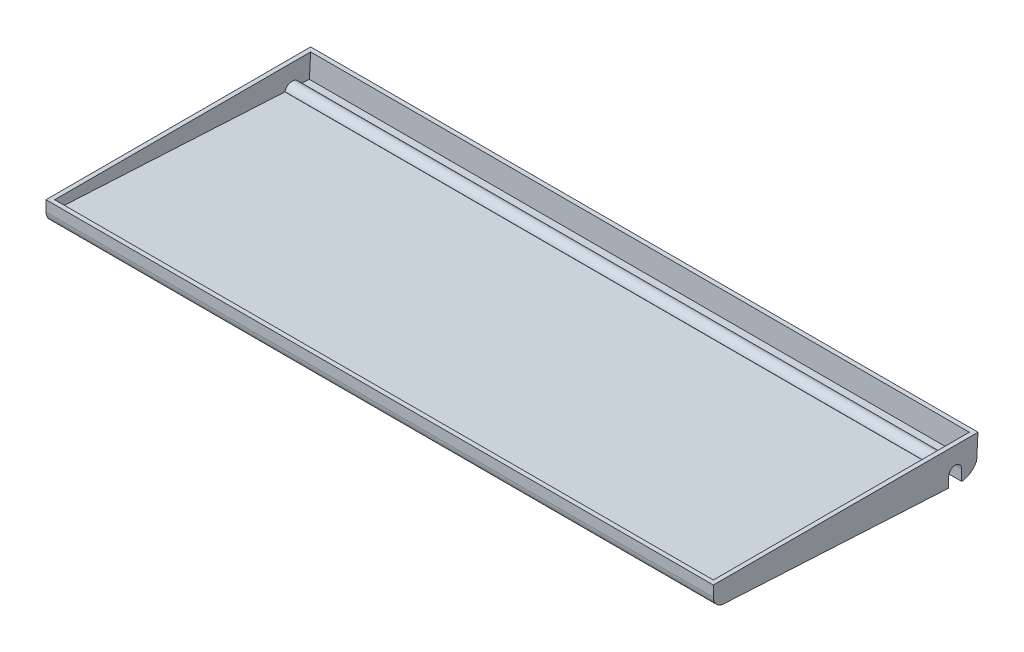
ISO-10303-21;
HEADER;
FILE_DESCRIPTION(('STEP AP214'),'2;1');
FILE_NAME('part.step','',(''),(''),'','','');
FILE_SCHEMA(('AUTOMOTIVE_DESIGN { 1 0 10303 214 1 1 1 1 }'));
ENDSEC;
DATA;
#1=APPLICATION_CONTEXT('core data for automotive mechanical design processes');
#2=APPLICATION_PROTOCOL_DEFINITION('international standard','automotive_design',2000,#1);
#3=PRODUCT_CONTEXT('',#1,'mechanical');
#4=PRODUCT('Part','Part','',(#3));
#5=PRODUCT_RELATED_PRODUCT_CATEGORY('part','',(#4));
#6=PRODUCT_DEFINITION_FORMATION('','',#4);
#7=PRODUCT_DEFINITION_CONTEXT('part definition',#1,'design');
#8=PRODUCT_DEFINITION('design','',#6,#7);
#9=PRODUCT_DEFINITION_SHAPE('','',#8);
#10=(LENGTH_UNIT() NAMED_UNIT(*) SI_UNIT(.MILLI.,.METRE.));
#11=(NAMED_UNIT(*) PLANE_ANGLE_UNIT() SI_UNIT($,.RADIAN.));
#12=(NAMED_UNIT(*) SI_UNIT($,.STERADIAN.) SOLID_ANGLE_UNIT());
#13=UNCERTAINTY_MEASURE_WITH_UNIT(LENGTH_MEASURE(1.E-05),#10,'distance_accuracy_value','');
#14=(GEOMETRIC_REPRESENTATION_CONTEXT(3) GLOBAL_UNCERTAINTY_ASSIGNED_CONTEXT((#13)) GLOBAL_UNIT_ASSIGNED_CONTEXT((#10,
#11,#12)) REPRESENTATION_CONTEXT('',''));
#15=CARTESIAN_POINT('',(0.,0.,0.));
#16=DIRECTION('',(0.,0.,1.));
#17=DIRECTION('',(1.,0.,0.));
#18=AXIS2_PLACEMENT_3D('',#15,#16,#17);
#19=CARTESIAN_POINT('',(310.007,3.55516985645839,56.4337520233221));
#20=DIRECTION('',(0.,0.998514417427364,-0.0544881472403947));
#21=DIRECTION('',(0.,0.0544881472403947,0.998514417427365));
#22=AXIS2_PLACEMENT_3D('',#19,#20,#21);
#23=PLANE('',#22);
#24=DIRECTION('',(0.,0.0544881472403947,0.998514417427365));
#25=VECTOR('',#24,1.);
#26=CARTESIAN_POINT('',(308.0004,-2.73716144424646,-58.8754269668086));
#27=LINE('',#26,#25);
#28=CARTESIAN_POINT('',(308.0004,-2.11631125757896,-47.498129447131));
#29=VERTEX_POINT('',#28);
#30=CARTESIAN_POINT('',(308.0004,3.73309519108161,59.6942962121904));
#31=VERTEX_POINT('',#30);
#32=EDGE_CURVE('E240',#29,#31,#27,.T.);
#33=ORIENTED_EDGE('',*,*,#32,.F.);
#34=DIRECTION('',(1.,0.,0.));
#35=VECTOR('',#34,1.);
#36=CARTESIAN_POINT('',(-0.002000000000002,-2.11631125757896,-47.498129447131));
#37=LINE('',#36,#35);
#38=CARTESIAN_POINT('',(2.0066,-2.11631125757896,-47.498129447131));
#39=VERTEX_POINT('',#38);
#40=EDGE_CURVE('E192',#39,#29,#37,.T.);
#41=ORIENTED_EDGE('',*,*,#40,.F.);
#42=DIRECTION('',(0.,-0.0544881472403947,-0.998514417427365));
#43=VECTOR('',#42,1.);
#44=CARTESIAN_POINT('',(2.0066,-2.73716144424646,-58.8754269668086));
#45=LINE('',#44,#43);
#46=CARTESIAN_POINT('',(2.0066,3.73309519108152,59.6942962121904));
#47=VERTEX_POINT('',#46);
#48=EDGE_CURVE('E180',#47,#39,#45,.T.);
#49=ORIENTED_EDGE('',*,*,#48,.F.);
#50=DIRECTION('',(-1.,0.,0.));
#51=VECTOR('',#50,1.);
#52=CARTESIAN_POINT('',(2.0066,3.73309519108161,59.6942962121904));
#53=LINE('',#52,#51);
#54=EDGE_CURVE('E238',#31,#47,#53,.T.);
#55=ORIENTED_EDGE('',*,*,#54,.F.);
#56=EDGE_LOOP('',(#33,#41,#49,#55));
#57=FACE_BOUND('',#56,.T.);
#58=ADVANCED_FACE('F47',(#57),#23,.T.);
#59=CARTESIAN_POINT('',(308.0004,-341.383942595809,-40.3957381893411));
#60=DIRECTION('',(1.,0.,0.));
#61=DIRECTION('',(0.,0.,-1.));
#62=AXIS2_PLACEMENT_3D('',#59,#60,#61);
#63=PLANE('',#62);
#64=CARTESIAN_POINT('',(308.0004,-2.73716144424654,-58.8754269668086));
#65=VERTEX_POINT('',#64);
#66=CARTESIAN_POINT('',(308.0004,-2.48821285214836,-54.313356663491));
#67=VERTEX_POINT('',#66);
#68=EDGE_CURVE('E242',#65,#67,#27,.T.);
#69=ORIENTED_EDGE('',*,*,#68,.T.);
#70=CARTESIAN_POINT('',(308.0004,-2.41685241101729,-54.0695869208206));
#71=DIRECTION('',(-1.,0.,0.));
#72=DIRECTION('',(0.,0.,1.));
#73=AXIS2_PLACEMENT_3D('',#70,#71,#72);
#74=CIRCLE('',#73,0.254);
#75=CARTESIAN_POINT('',(308.0004,-2.37244136079705,-54.319674222814));
#76=VERTEX_POINT('',#75);
#77=EDGE_CURVE('E62',#67,#76,#74,.F.);
#78=ORIENTED_EDGE('',*,*,#77,.T.);
#79=CARTESIAN_POINT('',(308.0004,-2.98531385383633,-50.8684694553052));
#80=DIRECTION('',(-1.,0.,0.));
#81=DIRECTION('',(0.,0.,1.));
#82=AXIS2_PLACEMENT_3D('',#79,#80,#81);
#83=CIRCLE('',#82,3.5052);
#84=CARTESIAN_POINT('',(308.0004,-2.00053976622766,-47.504447006454));
#85=VERTEX_POINT('',#84);
#86=EDGE_CURVE('E67',#85,#76,#83,.T.);
#87=ORIENTED_EDGE('',*,*,#86,.F.);
#88=CARTESIAN_POINT('',(308.0004,-2.07190020735872,-47.7482167491244));
#89=DIRECTION('',(-1.,0.,0.));
#90=DIRECTION('',(0.,0.,1.));
#91=AXIS2_PLACEMENT_3D('',#88,#89,#90);
#92=CIRCLE('',#91,0.254000000000001);
#93=EDGE_CURVE('E531',#29,#85,#92,.T.);
#94=ORIENTED_EDGE('',*,*,#93,.F.);
#95=ORIENTED_EDGE('',*,*,#32,.T.);
#96=DIRECTION('',(0.,0.998514417427364,-0.0544881472403947));
#97=VECTOR('',#96,1.);
#98=CARTESIAN_POINT('',(308.0004,-341.383942595809,78.5270618106589));
#99=LINE('',#98,#97);
#100=CARTESIAN_POINT('',(308.0004,8.00099999999999,59.4614));
#101=VERTEX_POINT('',#100);
#102=EDGE_CURVE('E257',#31,#101,#99,.T.);
#103=ORIENTED_EDGE('',*,*,#102,.T.);
#104=DIRECTION('',(0.,0.,-1.));
#105=VECTOR('',#104,1.);
#106=CARTESIAN_POINT('',(308.0004,8.00100000000003,-59.4614));
#107=LINE('',#106,#105);
#108=CARTESIAN_POINT('',(308.0004,8.00100000000003,-59.4614));
#109=VERTEX_POINT('',#108);
#110=EDGE_CURVE('E252',#101,#109,#107,.T.);
#111=ORIENTED_EDGE('',*,*,#110,.T.);
#112=DIRECTION('',(0.,0.998514417427364,-0.0544881472403947));
#113=VECTOR('',#112,1.);
#114=CARTESIAN_POINT('',(308.0004,-341.383942595809,-40.3957381893411));
#115=LINE('',#114,#113);
#116=EDGE_CURVE('E241',#65,#109,#115,.T.);
#117=ORIENTED_EDGE('',*,*,#116,.F.);
#118=EDGE_LOOP('',(#69,#78,#87,#94,#95,#103,#111,#117));
#119=FACE_BOUND('',#118,.T.);
#120=ADVANCED_FACE('F358',(#119),#63,.F.);
#121=CARTESIAN_POINT('',(2.0066,-341.383942595809,-40.3957381893411));
#122=DIRECTION('',(-1.,0.,0.));
#123=DIRECTION('',(0.,0.,1.));
#124=AXIS2_PLACEMENT_3D('',#121,#122,#123);
#125=PLANE('',#124);
#126=CARTESIAN_POINT('',(2.0066,-2.98531385383633,-50.8684694553052));
#127=DIRECTION('',(-1.,0.,0.));
#128=DIRECTION('',(0.,0.,1.));
#129=AXIS2_PLACEMENT_3D('',#126,#127,#128);
#130=CIRCLE('',#129,3.5052);
#131=CARTESIAN_POINT('',(2.0066,-2.00053976622766,-47.504447006454));
#132=VERTEX_POINT('',#131);
#133=CARTESIAN_POINT('',(2.0066,-2.37244136079705,-54.319674222814));
#134=VERTEX_POINT('',#133);
#135=EDGE_CURVE('E186',#132,#134,#130,.T.);
#136=ORIENTED_EDGE('',*,*,#135,.T.);
#137=CARTESIAN_POINT('',(2.0066,-2.41685241101729,-54.0695869208206));
#138=DIRECTION('',(-1.,0.,0.));
#139=DIRECTION('',(0.,0.,1.));
#140=AXIS2_PLACEMENT_3D('',#137,#138,#139);
#141=CIRCLE('',#140,0.254);
#142=CARTESIAN_POINT('',(2.0066,-2.48821285214836,-54.313356663491));
#143=VERTEX_POINT('',#142);
#144=EDGE_CURVE('E183',#143,#134,#141,.F.);
#145=ORIENTED_EDGE('',*,*,#144,.F.);
#146=CARTESIAN_POINT('',(2.0066,-2.73716144424654,-58.8754269668086));
#147=VERTEX_POINT('',#146);
#148=EDGE_CURVE('E170',#143,#147,#45,.T.);
#149=ORIENTED_EDGE('',*,*,#148,.T.);
#150=DIRECTION('',(0.,0.998514417427364,-0.0544881472403947));
#151=VECTOR('',#150,1.);
#152=CARTESIAN_POINT('',(2.0066,-341.383942595809,-40.3957381893411));
#153=LINE('',#152,#151);
#154=CARTESIAN_POINT('',(2.00660000000003,8.00100000000003,-59.4614));
#155=VERTEX_POINT('',#154);
#156=EDGE_CURVE('E255',#147,#155,#153,.T.);
#157=ORIENTED_EDGE('',*,*,#156,.T.);
#158=DIRECTION('',(0.,0.,1.));
#159=VECTOR('',#158,1.);
#160=CARTESIAN_POINT('',(2.0066,8.00100000000003,-59.4614));
#161=LINE('',#160,#159);
#162=CARTESIAN_POINT('',(2.0066,8.00099999999999,59.4614));
#163=VERTEX_POINT('',#162);
#164=EDGE_CURVE('E246',#155,#163,#161,.T.);
#165=ORIENTED_EDGE('',*,*,#164,.T.);
#166=DIRECTION('',(0.,0.998514417427364,-0.0544881472403947));
#167=VECTOR('',#166,1.);
#168=CARTESIAN_POINT('',(2.0066,-341.383942595809,78.5270618106589));
#169=LINE('',#168,#167);
#170=EDGE_CURVE('E259',#47,#163,#169,.T.);
#171=ORIENTED_EDGE('',*,*,#170,.F.);
#172=ORIENTED_EDGE('',*,*,#48,.T.);
#173=CARTESIAN_POINT('',(2.0066,-2.07190020735872,-47.7482167491244));
#174=DIRECTION('',(-1.,0.,0.));
#175=DIRECTION('',(0.,0.,1.));
#176=AXIS2_PLACEMENT_3D('',#173,#174,#175);
#177=CIRCLE('',#176,0.254000000000001);
#178=EDGE_CURVE('E189',#39,#132,#177,.T.);
#179=ORIENTED_EDGE('',*,*,#178,.T.);
#180=EDGE_LOOP('',(#136,#145,#149,#157,#165,#171,#172,#179));
#181=FACE_BOUND('',#180,.T.);
#182=ADVANCED_FACE('F184',(#181),#125,.F.);
#183=CARTESIAN_POINT('',(310.007,0.,-53.467));
#184=DIRECTION('',(-1.,0.,0.));
#185=DIRECTION('',(0.,0.,1.));
#186=AXIS2_PLACEMENT_3D('',#183,#184,#185);
#187=CYLINDRICAL_SURFACE('',#186,8.001);
#188=CARTESIAN_POINT('',(310.007,0.,-53.467));
#189=DIRECTION('',(1.,0.,0.));
#190=DIRECTION('',(0.,0.,-1.));
#191=AXIS2_PLACEMENT_3D('',#188,#189,#190);
#192=CIRCLE('',#191,8.001);
#193=CARTESIAN_POINT('',(310.007,-7.99106148552284,-53.8656694553052));
#194=VERTEX_POINT('',#193);
#195=CARTESIAN_POINT('',(310.007,-2.84999799689181,-60.9431963870482));
#196=VERTEX_POINT('',#195);
#197=EDGE_CURVE('E278',#194,#196,#192,.T.);
#198=ORIENTED_EDGE('',*,*,#197,.F.);
#199=DIRECTION('',(1.,0.,0.));
#200=VECTOR('',#199,1.);
#201=CARTESIAN_POINT('',(0.,-7.99106148552284,-53.8656694553052));
#202=LINE('',#201,#200);
#203=CARTESIAN_POINT('',(0.,-7.99106148552284,-53.8656694553052));
#204=VERTEX_POINT('',#203);
#205=EDGE_CURVE('E212',#204,#194,#202,.T.);
#206=ORIENTED_EDGE('',*,*,#205,.F.);
#207=CARTESIAN_POINT('',(0.,0.,-53.467));
#208=DIRECTION('',(1.,0.,0.));
#209=DIRECTION('',(0.,0.,-1.));
#210=AXIS2_PLACEMENT_3D('',#207,#208,#209);
#211=CIRCLE('',#210,8.001);
#212=CARTESIAN_POINT('',(0.,-2.84999799689181,-60.9431963870482));
#213=VERTEX_POINT('',#212);
#214=EDGE_CURVE('E289',#204,#213,#211,.T.);
#215=ORIENTED_EDGE('',*,*,#214,.T.);
#216=DIRECTION('',(-1.,0.,0.));
#217=VECTOR('',#216,1.);
#218=CARTESIAN_POINT('',(310.007,-2.84999799689181,-60.9431963870482));
#219=LINE('',#218,#217);
#220=EDGE_CURVE('E263',#196,#213,#219,.T.);
#221=ORIENTED_EDGE('',*,*,#220,.F.);
#222=EDGE_LOOP('',(#198,#206,#215,#221));
#223=FACE_BOUND('',#222,.T.);
#224=ADVANCED_FACE('F339',(#223),#187,.T.);
#225=CARTESIAN_POINT('',(310.007,2.99719999999999,56.4642));
#226=DIRECTION('',(1.,0.,0.));
#227=DIRECTION('',(0.,0.,-1.));
#228=AXIS2_PLACEMENT_3D('',#225,#226,#227);
#229=PLANE('',#228);
#230=DIRECTION('',(0.,-1.,0.));
#231=VECTOR('',#230,1.);
#232=CARTESIAN_POINT('',(310.007,-2.98531385383633,-47.8712694553052));
#233=LINE('',#232,#231);
#234=CARTESIAN_POINT('',(310.007,-2.98531385383633,-47.8712694553052));
#235=VERTEX_POINT('',#234);
#236=CARTESIAN_POINT('',(310.007,-7.7075492109486,-47.8712694553052));
#237=VERTEX_POINT('',#236);
#238=EDGE_CURVE('E206',#235,#237,#233,.T.);
#239=ORIENTED_EDGE('',*,*,#238,.F.);
#240=CARTESIAN_POINT('',(310.007,-2.98531385383633,-50.8684694553052));
#241=DIRECTION('',(1.,0.,0.));
#242=DIRECTION('',(0.,0.,-1.));
#243=AXIS2_PLACEMENT_3D('',#240,#241,#242);
#244=CIRCLE('',#243,2.9972);
#245=CARTESIAN_POINT('',(310.007,-2.98531385383633,-53.8656694553052));
#246=VERTEX_POINT('',#245);
#247=EDGE_CURVE('E215',#246,#235,#244,.T.);
#248=ORIENTED_EDGE('',*,*,#247,.F.);
#249=DIRECTION('',(0.,1.,0.));
#250=VECTOR('',#249,1.);
#251=CARTESIAN_POINT('',(310.007,-2.98531385383633,-53.8656694553052));
#252=LINE('',#251,#250);
#253=EDGE_CURVE('E200',#194,#246,#252,.T.);
#254=ORIENTED_EDGE('',*,*,#253,.F.);
#255=ORIENTED_EDGE('',*,*,#197,.T.);
#256=DIRECTION('',(0.,0.0544881472403947,0.998514417427365));
#257=VECTOR('',#256,1.);
#258=CARTESIAN_POINT('',(310.007,3.55516985645839,56.4337520233221));
#259=LINE('',#258,#257);
#260=CARTESIAN_POINT('',(310.007,-2.84633493296738,-60.8760694553052));
#261=VERTEX_POINT('',#260);
#262=EDGE_CURVE('E266',#196,#261,#259,.T.);
#263=ORIENTED_EDGE('',*,*,#262,.T.);
#264=DIRECTION('',(0.,0.998514417427364,-0.0544881472403947));
#265=VECTOR('',#264,1.);
#266=CARTESIAN_POINT('',(310.007,-341.383942595809,-42.4023381893411));
#267=LINE('',#266,#265);
#268=CARTESIAN_POINT('',(310.007,8.00100000000003,-61.468));
#269=VERTEX_POINT('',#268);
#270=EDGE_CURVE('E223',#261,#269,#267,.T.);
#271=ORIENTED_EDGE('',*,*,#270,.T.);
#272=DIRECTION('',(0.,0.,1.));
#273=VECTOR('',#272,1.);
#274=CARTESIAN_POINT('',(310.007,8.00099999999999,61.468));
#275=LINE('',#274,#273);
#276=CARTESIAN_POINT('',(310.007,8.00099999999999,61.468));
#277=VERTEX_POINT('',#276);
#278=EDGE_CURVE('E280',#269,#277,#275,.T.);
#279=ORIENTED_EDGE('',*,*,#278,.T.);
#280=DIRECTION('',(0.,-1.,0.));
#281=VECTOR('',#280,1.);
#282=CARTESIAN_POINT('',(310.007,8.00099999999999,61.468));
#283=LINE('',#282,#281);
#284=CARTESIAN_POINT('',(310.007,2.99719999999999,61.468));
#285=VERTEX_POINT('',#284);
#286=EDGE_CURVE('E270',#277,#285,#283,.T.);
#287=ORIENTED_EDGE('',*,*,#286,.T.);
#288=CARTESIAN_POINT('',(310.007,2.99719999999999,56.4642));
#289=DIRECTION('',(1.,0.,0.));
#290=DIRECTION('',(0.,0.,-1.));
#291=AXIS2_PLACEMENT_3D('',#288,#289,#290);
#292=CIRCLE('',#291,5.0038);
#293=CARTESIAN_POINT('',(310.007,-1.99916644192306,56.7368477911615));
#294=VERTEX_POINT('',#293);
#295=EDGE_CURVE('E272',#285,#294,#292,.T.);
#296=ORIENTED_EDGE('',*,*,#295,.T.);
#297=DIRECTION('',(0.,-0.0544881472403947,-0.998514417427365));
#298=VECTOR('',#297,1.);
#299=CARTESIAN_POINT('',(310.007,-1.99916644192306,56.7368477911615));
#300=LINE('',#299,#298);
#301=EDGE_CURVE('E275',#294,#237,#300,.T.);
#302=ORIENTED_EDGE('',*,*,#301,.T.);
#303=EDGE_LOOP('',(#239,#248,#254,#255,#263,#271,#279,#287,#296,#302));
#304=FACE_BOUND('',#303,.T.);
#305=ADVANCED_FACE('F320',(#304),#229,.T.);
#306=CARTESIAN_POINT('',(0.,2.99719999999999,56.4642));
#307=DIRECTION('',(1.,0.,0.));
#308=DIRECTION('',(0.,0.,-1.));
#309=AXIS2_PLACEMENT_3D('',#306,#307,#308);
#310=PLANE('',#309);
#311=CARTESIAN_POINT('',(0.,-2.98531385383633,-50.8684694553052));
#312=DIRECTION('',(1.,0.,0.));
#313=DIRECTION('',(0.,0.,-1.));
#314=AXIS2_PLACEMENT_3D('',#311,#312,#313);
#315=CIRCLE('',#314,2.9972);
#316=CARTESIAN_POINT('',(0.,-2.98531385383633,-53.8656694553052));
#317=VERTEX_POINT('',#316);
#318=CARTESIAN_POINT('',(0.,-2.98531385383633,-47.8712694553052));
#319=VERTEX_POINT('',#318);
#320=EDGE_CURVE('E205',#317,#319,#315,.T.);
#321=ORIENTED_EDGE('',*,*,#320,.T.);
#322=DIRECTION('',(0.,-1.,0.));
#323=VECTOR('',#322,1.);
#324=CARTESIAN_POINT('',(0.,-2.98531385383633,-47.8712694553052));
#325=LINE('',#324,#323);
#326=CARTESIAN_POINT('',(0.,-7.7075492109486,-47.8712694553052));
#327=VERTEX_POINT('',#326);
#328=EDGE_CURVE('E209',#319,#327,#325,.T.);
#329=ORIENTED_EDGE('',*,*,#328,.T.);
#330=DIRECTION('',(0.,-0.0544881472403947,-0.998514417427365));
#331=VECTOR('',#330,1.);
#332=CARTESIAN_POINT('',(0.,-1.99916644192306,56.7368477911615));
#333=LINE('',#332,#331);
#334=CARTESIAN_POINT('',(0.,-1.99916644192306,56.7368477911615));
#335=VERTEX_POINT('',#334);
#336=EDGE_CURVE('E286',#335,#327,#333,.T.);
#337=ORIENTED_EDGE('',*,*,#336,.F.);
#338=CARTESIAN_POINT('',(0.,2.99719999999999,56.4642));
#339=DIRECTION('',(1.,0.,0.));
#340=DIRECTION('',(0.,0.,-1.));
#341=AXIS2_PLACEMENT_3D('',#338,#339,#340);
#342=CIRCLE('',#341,5.0038);
#343=CARTESIAN_POINT('',(0.,2.99719999999999,61.468));
#344=VERTEX_POINT('',#343);
#345=EDGE_CURVE('E284',#344,#335,#342,.T.);
#346=ORIENTED_EDGE('',*,*,#345,.F.);
#347=DIRECTION('',(0.,-1.,0.));
#348=VECTOR('',#347,1.);
#349=CARTESIAN_POINT('',(0.,8.00099999999999,61.468));
#350=LINE('',#349,#348);
#351=CARTESIAN_POINT('',(0.,8.00099999999999,61.468));
#352=VERTEX_POINT('',#351);
#353=EDGE_CURVE('E269',#352,#344,#350,.T.);
#354=ORIENTED_EDGE('',*,*,#353,.F.);
#355=DIRECTION('',(0.,0.,1.));
#356=VECTOR('',#355,1.);
#357=CARTESIAN_POINT('',(0.,8.00099999999999,61.468));
#358=LINE('',#357,#356);
#359=CARTESIAN_POINT('',(0.,8.00100000000003,-61.468));
#360=VERTEX_POINT('',#359);
#361=EDGE_CURVE('E273',#360,#352,#358,.T.);
#362=ORIENTED_EDGE('',*,*,#361,.F.);
#363=DIRECTION('',(0.,0.998514417427364,-0.0544881472403947));
#364=VECTOR('',#363,1.);
#365=CARTESIAN_POINT('',(0.,-341.383942595809,-42.4023381893411));
#366=LINE('',#365,#364);
#367=CARTESIAN_POINT('',(0.,-2.84633493296726,-60.8760694553052));
#368=VERTEX_POINT('',#367);
#369=EDGE_CURVE('E233',#368,#360,#366,.T.);
#370=ORIENTED_EDGE('',*,*,#369,.F.);
#371=DIRECTION('',(0.,0.0544881472403947,0.998514417427365));
#372=VECTOR('',#371,1.);
#373=CARTESIAN_POINT('',(0.,3.55516985645839,56.4337520233221));
#374=LINE('',#373,#372);
#375=EDGE_CURVE('E13',#213,#368,#374,.T.);
#376=ORIENTED_EDGE('',*,*,#375,.F.);
#377=ORIENTED_EDGE('',*,*,#214,.F.);
#378=DIRECTION('',(0.,1.,0.));
#379=VECTOR('',#378,1.);
#380=CARTESIAN_POINT('',(0.,-2.98531385383633,-53.8656694553052));
#381=LINE('',#380,#379);
#382=EDGE_CURVE('E202',#204,#317,#381,.T.);
#383=ORIENTED_EDGE('',*,*,#382,.T.);
#384=EDGE_LOOP('',(#321,#329,#337,#346,#354,#362,#370,#376,#377,#383));
#385=FACE_BOUND('',#384,.T.);
#386=ADVANCED_FACE('F313',(#385),#310,.F.);
#387=CARTESIAN_POINT('',(310.007,8.00099999999999,61.468));
#388=DIRECTION('',(0.,0.,-1.));
#389=DIRECTION('',(-1.,0.,0.));
#390=AXIS2_PLACEMENT_3D('',#387,#388,#389);
#391=PLANE('',#390);
#392=ORIENTED_EDGE('',*,*,#353,.T.);
#393=DIRECTION('',(-1.,0.,0.));
#394=VECTOR('',#393,1.);
#395=CARTESIAN_POINT('',(310.007,2.99719999999999,61.468));
#396=LINE('',#395,#394);
#397=EDGE_CURVE('E55',#285,#344,#396,.T.);
#398=ORIENTED_EDGE('',*,*,#397,.F.);
#399=ORIENTED_EDGE('',*,*,#286,.F.);
#400=DIRECTION('',(-1.,0.,0.));
#401=VECTOR('',#400,1.);
#402=CARTESIAN_POINT('',(310.007,8.00099999999999,61.468));
#403=LINE('',#402,#401);
#404=EDGE_CURVE('E282',#277,#352,#403,.T.);
#405=ORIENTED_EDGE('',*,*,#404,.T.);
#406=EDGE_LOOP('',(#392,#398,#399,#405));
#407=FACE_BOUND('',#406,.T.);
#408=ADVANCED_FACE('F49',(#407),#391,.F.);
#409=CARTESIAN_POINT('',(310.007,2.99719999999999,56.4642));
#410=DIRECTION('',(-1.,0.,0.));
#411=DIRECTION('',(0.,0.,1.));
#412=AXIS2_PLACEMENT_3D('',#409,#410,#411);
#413=CYLINDRICAL_SURFACE('',#412,5.0038);
#414=ORIENTED_EDGE('',*,*,#345,.T.);
#415=DIRECTION('',(-1.,0.,0.));
#416=VECTOR('',#415,1.);
#417=CARTESIAN_POINT('',(310.007,-1.99916644192306,56.7368477911615));
#418=LINE('',#417,#416);
#419=EDGE_CURVE('E297',#294,#335,#418,.T.);
#420=ORIENTED_EDGE('',*,*,#419,.F.);
#421=ORIENTED_EDGE('',*,*,#295,.F.);
#422=ORIENTED_EDGE('',*,*,#397,.T.);
#423=EDGE_LOOP('',(#414,#420,#421,#422));
#424=FACE_BOUND('',#423,.T.);
#425=ADVANCED_FACE('F303',(#424),#413,.T.);
#426=CARTESIAN_POINT('',(310.007,-1.99916644192306,56.7368477911615));
#427=DIRECTION('',(0.,0.998514417427364,-0.0544881472403947));
#428=DIRECTION('',(0.,0.0544881472403947,0.998514417427365));
#429=AXIS2_PLACEMENT_3D('',#426,#427,#428);
#430=PLANE('',#429);
#431=ORIENTED_EDGE('',*,*,#336,.T.);
#432=DIRECTION('',(1.,0.,0.));
#433=VECTOR('',#432,1.);
#434=CARTESIAN_POINT('',(0.,-7.7075492109486,-47.8712694553052));
#435=LINE('',#434,#433);
#436=EDGE_CURVE('E220',#327,#237,#435,.T.);
#437=ORIENTED_EDGE('',*,*,#436,.T.);
#438=ORIENTED_EDGE('',*,*,#301,.F.);
#439=ORIENTED_EDGE('',*,*,#419,.T.);
#440=EDGE_LOOP('',(#431,#437,#438,#439));
#441=FACE_BOUND('',#440,.T.);
#442=ADVANCED_FACE('F316',(#441),#430,.F.);
#443=CARTESIAN_POINT('',(310.007,8.00099999999999,61.468));
#444=DIRECTION('',(0.,-1.,0.));
#445=DIRECTION('',(0.,0.,-1.));
#446=AXIS2_PLACEMENT_3D('',#443,#444,#445);
#447=PLANE('',#446);
#448=ORIENTED_EDGE('',*,*,#164,.F.);
#449=DIRECTION('',(-1.,0.,0.));
#450=VECTOR('',#449,1.);
#451=CARTESIAN_POINT('',(2.0066,8.00100000000003,-59.4614));
#452=LINE('',#451,#450);
#453=EDGE_CURVE('E232',#109,#155,#452,.T.);
#454=ORIENTED_EDGE('',*,*,#453,.F.);
#455=ORIENTED_EDGE('',*,*,#110,.F.);
#456=DIRECTION('',(1.,0.,0.));
#457=VECTOR('',#456,1.);
#458=CARTESIAN_POINT('',(2.0066,8.00099999999999,59.4614));
#459=LINE('',#458,#457);
#460=EDGE_CURVE('E249',#163,#101,#459,.T.);
#461=ORIENTED_EDGE('',*,*,#460,.F.);
#462=EDGE_LOOP('',(#448,#454,#455,#461));
#463=FACE_BOUND('',#462,.T.);
#464=ORIENTED_EDGE('',*,*,#361,.T.);
#465=ORIENTED_EDGE('',*,*,#404,.F.);
#466=ORIENTED_EDGE('',*,*,#278,.F.);
#467=DIRECTION('',(-1.,0.,0.));
#468=VECTOR('',#467,1.);
#469=CARTESIAN_POINT('',(310.007,8.00100000000003,-61.468));
#470=LINE('',#469,#468);
#471=EDGE_CURVE('E294',#269,#360,#470,.T.);
#472=ORIENTED_EDGE('',*,*,#471,.T.);
#473=EDGE_LOOP('',(#464,#465,#466,#472));
#474=FACE_BOUND('',#473,.T.);
#475=ADVANCED_FACE('F324',(#463,#474),#447,.F.);
#476=CARTESIAN_POINT('',(0.,-341.383942595809,-42.4023381893411));
#477=DIRECTION('',(0.,-0.0544881472403947,-0.998514417427364));
#478=DIRECTION('',(0.,0.998514417427365,-0.0544881472403947));
#479=AXIS2_PLACEMENT_3D('',#476,#477,#478);
#480=PLANE('',#479);
#481=ORIENTED_EDGE('',*,*,#369,.T.);
#482=ORIENTED_EDGE('',*,*,#471,.F.);
#483=ORIENTED_EDGE('',*,*,#270,.F.);
#484=DIRECTION('',(1.,0.,0.));
#485=VECTOR('',#484,1.);
#486=CARTESIAN_POINT('',(0.,-2.84633493296726,-60.8760694553052));
#487=LINE('',#486,#485);
#488=EDGE_CURVE('E229',#368,#261,#487,.T.);
#489=ORIENTED_EDGE('',*,*,#488,.F.);
#490=EDGE_LOOP('',(#481,#482,#483,#489));
#491=FACE_BOUND('',#490,.T.);
#492=ADVANCED_FACE('F330',(#491),#480,.T.);
#493=CARTESIAN_POINT('',(310.007,3.55516985645839,56.4337520233221));
#494=DIRECTION('',(0.,0.998514417427364,-0.0544881472403947));
#495=DIRECTION('',(0.,0.0544881472403947,0.998514417427365));
#496=AXIS2_PLACEMENT_3D('',#493,#494,#495);
#497=PLANE('',#496);
#498=ORIENTED_EDGE('',*,*,#220,.T.);
#499=ORIENTED_EDGE('',*,*,#375,.T.);
#500=ORIENTED_EDGE('',*,*,#488,.T.);
#501=ORIENTED_EDGE('',*,*,#262,.F.);
#502=EDGE_LOOP('',(#498,#499,#500,#501));
#503=FACE_BOUND('',#502,.T.);
#504=ADVANCED_FACE('F333',(#503),#497,.T.);
#505=CARTESIAN_POINT('',(2.0066,-341.383942595809,-40.3957381893411));
#506=DIRECTION('',(0.,-0.0544881472403947,-0.998514417427364));
#507=DIRECTION('',(0.,0.998514417427365,-0.0544881472403947));
#508=AXIS2_PLACEMENT_3D('',#505,#506,#507);
#509=PLANE('',#508);
#510=DIRECTION('',(1.,0.,0.));
#511=VECTOR('',#510,1.);
#512=CARTESIAN_POINT('',(2.0066,-2.73716144424646,-58.8754269668086));
#513=LINE('',#512,#511);
#514=EDGE_CURVE('E176',#147,#65,#513,.T.);
#515=ORIENTED_EDGE('',*,*,#514,.T.);
#516=ORIENTED_EDGE('',*,*,#116,.T.);
#517=ORIENTED_EDGE('',*,*,#453,.T.);
#518=ORIENTED_EDGE('',*,*,#156,.F.);
#519=EDGE_LOOP('',(#515,#516,#517,#518));
#520=FACE_BOUND('',#519,.T.);
#521=ADVANCED_FACE('F370',(#520),#509,.F.);
#522=CARTESIAN_POINT('',(2.0066,-341.383942595809,78.5270618106589));
#523=DIRECTION('',(0.,0.0544881472403947,0.998514417427364));
#524=DIRECTION('',(0.,-0.998514417427365,0.0544881472403947));
#525=AXIS2_PLACEMENT_3D('',#522,#523,#524);
#526=PLANE('',#525);
#527=ORIENTED_EDGE('',*,*,#54,.T.);
#528=ORIENTED_EDGE('',*,*,#170,.T.);
#529=ORIENTED_EDGE('',*,*,#460,.T.);
#530=ORIENTED_EDGE('',*,*,#102,.F.);
#531=EDGE_LOOP('',(#527,#528,#529,#530));
#532=FACE_BOUND('',#531,.T.);
#533=ADVANCED_FACE('F354',(#532),#526,.F.);
#534=DIRECTION('',(1.,0.,0.));
#535=VECTOR('',#534,1.);
#536=CARTESIAN_POINT('',(-0.002000000000002,-2.48821285214836,-54.313356663491));
#537=LINE('',#536,#535);
#538=EDGE_CURVE('E175',#143,#67,#537,.T.);
#539=ORIENTED_EDGE('',*,*,#538,.T.);
#540=ORIENTED_EDGE('',*,*,#68,.F.);
#541=ORIENTED_EDGE('',*,*,#514,.F.);
#542=ORIENTED_EDGE('',*,*,#148,.F.);
#543=EDGE_LOOP('',(#539,#540,#541,#542));
#544=FACE_BOUND('',#543,.T.);
#545=ADVANCED_FACE('F172',(#544),#23,.T.);
#546=CARTESIAN_POINT('',(0.,-2.98531385383633,-47.8712694553052));
#547=DIRECTION('',(0.,0.,1.));
#548=DIRECTION('',(1.,0.,0.));
#549=AXIS2_PLACEMENT_3D('',#546,#547,#548);
#550=PLANE('',#549);
#551=ORIENTED_EDGE('',*,*,#238,.T.);
#552=ORIENTED_EDGE('',*,*,#436,.F.);
#553=ORIENTED_EDGE('',*,*,#328,.F.);
#554=DIRECTION('',(1.,0.,0.));
#555=VECTOR('',#554,1.);
#556=CARTESIAN_POINT('',(0.,-2.98531385383633,-47.8712694553052));
#557=LINE('',#556,#555);
#558=EDGE_CURVE('E224',#319,#235,#557,.T.);
#559=ORIENTED_EDGE('',*,*,#558,.T.);
#560=EDGE_LOOP('',(#551,#552,#553,#559));
#561=FACE_BOUND('',#560,.T.);
#562=ADVANCED_FACE('F346',(#561),#550,.F.);
#563=CARTESIAN_POINT('',(0.,-2.98531385383633,-50.8684694553052));
#564=DIRECTION('',(1.,0.,0.));
#565=DIRECTION('',(0.,0.,-1.));
#566=AXIS2_PLACEMENT_3D('',#563,#564,#565);
#567=CYLINDRICAL_SURFACE('',#566,2.9972);
#568=ORIENTED_EDGE('',*,*,#247,.T.);
#569=ORIENTED_EDGE('',*,*,#558,.F.);
#570=ORIENTED_EDGE('',*,*,#320,.F.);
#571=DIRECTION('',(1.,0.,0.));
#572=VECTOR('',#571,1.);
#573=CARTESIAN_POINT('',(0.,-2.98531385383633,-53.8656694553052));
#574=LINE('',#573,#572);
#575=EDGE_CURVE('E226',#317,#246,#574,.T.);
#576=ORIENTED_EDGE('',*,*,#575,.T.);
#577=EDGE_LOOP('',(#568,#569,#570,#576));
#578=FACE_BOUND('',#577,.T.);
#579=ADVANCED_FACE('F344',(#578),#567,.F.);
#580=CARTESIAN_POINT('',(0.,-2.98531385383633,-53.8656694553052));
#581=DIRECTION('',(0.,0.,-1.));
#582=DIRECTION('',(-1.,0.,0.));
#583=AXIS2_PLACEMENT_3D('',#580,#581,#582);
#584=PLANE('',#583);
#585=ORIENTED_EDGE('',*,*,#253,.T.);
#586=ORIENTED_EDGE('',*,*,#575,.F.);
#587=ORIENTED_EDGE('',*,*,#382,.F.);
#588=ORIENTED_EDGE('',*,*,#205,.T.);
#589=EDGE_LOOP('',(#585,#586,#587,#588));
#590=FACE_BOUND('',#589,.T.);
#591=ADVANCED_FACE('F342',(#590),#584,.F.);
#592=CARTESIAN_POINT('',(-0.002000000000002,-2.41685241101729,-54.0695869208206));
#593=DIRECTION('',(1.,0.,0.));
#594=DIRECTION('',(0.,0.,-1.));
#595=AXIS2_PLACEMENT_3D('',#592,#593,#594);
#596=CYLINDRICAL_SURFACE('',#595,0.254);
#597=ORIENTED_EDGE('',*,*,#538,.F.);
#598=ORIENTED_EDGE('',*,*,#144,.T.);
#599=DIRECTION('',(1.,0.,0.));
#600=VECTOR('',#599,1.);
#601=CARTESIAN_POINT('',(-0.002000000000002,-2.37244136079705,-54.319674222814));
#602=LINE('',#601,#600);
#603=EDGE_CURVE('E529',#134,#76,#602,.T.);
#604=ORIENTED_EDGE('',*,*,#603,.T.);
#605=ORIENTED_EDGE('',*,*,#77,.F.);
#606=EDGE_LOOP('',(#597,#598,#604,#605));
#607=FACE_BOUND('',#606,.T.);
#608=ADVANCED_FACE('F191',(#607),#596,.T.);
#609=CARTESIAN_POINT('',(-0.002000000000002,-2.98531385383633,-50.8684694553052));
#610=DIRECTION('',(1.,0.,0.));
#611=DIRECTION('',(0.,0.,-1.));
#612=AXIS2_PLACEMENT_3D('',#609,#610,#611);
#613=CYLINDRICAL_SURFACE('',#612,3.5052);
#614=ORIENTED_EDGE('',*,*,#135,.F.);
#615=DIRECTION('',(1.,0.,0.));
#616=VECTOR('',#615,1.);
#617=CARTESIAN_POINT('',(-0.002000000000002,-2.00053976622766,-47.504447006454));
#618=LINE('',#617,#616);
#619=EDGE_CURVE('E195',#132,#85,#618,.T.);
#620=ORIENTED_EDGE('',*,*,#619,.T.);
#621=ORIENTED_EDGE('',*,*,#86,.T.);
#622=ORIENTED_EDGE('',*,*,#603,.F.);
#623=EDGE_LOOP('',(#614,#620,#621,#622));
#624=FACE_BOUND('',#623,.T.);
#625=ADVANCED_FACE('F496',(#624),#613,.T.);
#626=CARTESIAN_POINT('',(-0.002000000000002,-2.07190020735872,-47.7482167491244));
#627=DIRECTION('',(1.,0.,0.));
#628=DIRECTION('',(0.,0.,-1.));
#629=AXIS2_PLACEMENT_3D('',#626,#627,#628);
#630=CYLINDRICAL_SURFACE('',#629,0.254000000000001);
#631=ORIENTED_EDGE('',*,*,#178,.F.);
#632=ORIENTED_EDGE('',*,*,#40,.T.);
#633=ORIENTED_EDGE('',*,*,#93,.T.);
#634=ORIENTED_EDGE('',*,*,#619,.F.);
#635=EDGE_LOOP('',(#631,#632,#633,#634));
#636=FACE_BOUND('',#635,.T.);
#637=ADVANCED_FACE('F435',(#636),#630,.T.);
#638=CLOSED_SHELL('',(#58,#120,#182,#224,#305,#386,#408,#425,#442,#475,#492,#504,#521,#533,#545,
#562,#579,#591,#608,#625,#637));
#639=MANIFOLD_SOLID_BREP('B2',#638);
#640=ADVANCED_BREP_SHAPE_REPRESENTATION('',(#18,#639),#14);
#641=SHAPE_DEFINITION_REPRESENTATION(#9,#640);
ENDSEC;
END-ISO-10303-21;
